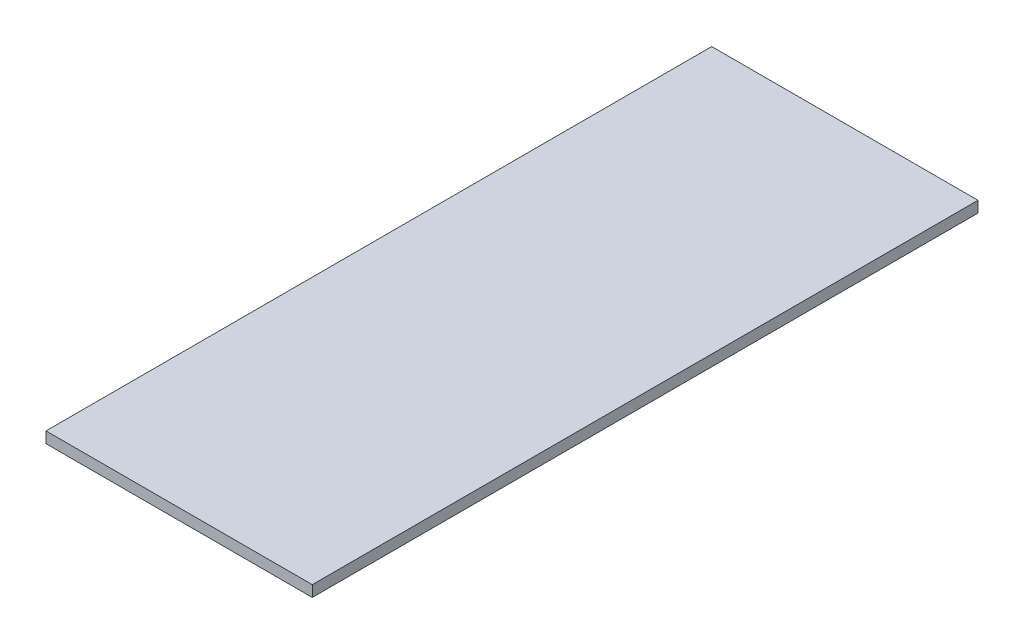
ISO-10303-21;
HEADER;
FILE_DESCRIPTION(('STEP AP214'),'2;1');
FILE_NAME('part.step','',(''),(''),'','','');
FILE_SCHEMA(('AUTOMOTIVE_DESIGN { 1 0 10303 214 1 1 1 1 }'));
ENDSEC;
DATA;
#1=APPLICATION_CONTEXT('core data for automotive mechanical design processes');
#2=APPLICATION_PROTOCOL_DEFINITION('international standard','automotive_design',2000,#1);
#3=PRODUCT_CONTEXT('',#1,'mechanical');
#4=PRODUCT('Part','Part','',(#3));
#5=PRODUCT_RELATED_PRODUCT_CATEGORY('part','',(#4));
#6=PRODUCT_DEFINITION_FORMATION('','',#4);
#7=PRODUCT_DEFINITION_CONTEXT('part definition',#1,'design');
#8=PRODUCT_DEFINITION('design','',#6,#7);
#9=PRODUCT_DEFINITION_SHAPE('','',#8);
#10=(LENGTH_UNIT() NAMED_UNIT(*) SI_UNIT(.MILLI.,.METRE.));
#11=(NAMED_UNIT(*) PLANE_ANGLE_UNIT() SI_UNIT($,.RADIAN.));
#12=(NAMED_UNIT(*) SI_UNIT($,.STERADIAN.) SOLID_ANGLE_UNIT());
#13=UNCERTAINTY_MEASURE_WITH_UNIT(LENGTH_MEASURE(1.E-05),#10,'distance_accuracy_value','');
#14=(GEOMETRIC_REPRESENTATION_CONTEXT(3) GLOBAL_UNCERTAINTY_ASSIGNED_CONTEXT((#13)) GLOBAL_UNIT_ASSIGNED_CONTEXT((#10,
#11,#12)) REPRESENTATION_CONTEXT('',''));
#15=CARTESIAN_POINT('',(0.,0.,0.));
#16=DIRECTION('',(0.,0.,1.));
#17=DIRECTION('',(1.,0.,0.));
#18=AXIS2_PLACEMENT_3D('',#15,#16,#17);
#19=CARTESIAN_POINT('',(0.,6.35,0.));
#20=DIRECTION('',(1.,0.,0.));
#21=DIRECTION('',(0.,0.,-1.));
#22=AXIS2_PLACEMENT_3D('',#19,#20,#21);
#23=PLANE('',#22);
#24=DIRECTION('',(0.,0.,1.));
#25=VECTOR('',#24,1.);
#26=CARTESIAN_POINT('',(0.,0.,0.));
#27=LINE('',#26,#25);
#28=CARTESIAN_POINT('',(0.,0.,-381.));
#29=VERTEX_POINT('',#28);
#30=CARTESIAN_POINT('',(0.,0.,0.));
#31=VERTEX_POINT('',#30);
#32=EDGE_CURVE('E80',#29,#31,#27,.T.);
#33=ORIENTED_EDGE('',*,*,#32,.T.);
#34=DIRECTION('',(0.,-1.,0.));
#35=VECTOR('',#34,1.);
#36=CARTESIAN_POINT('',(0.,6.35,0.));
#37=LINE('',#36,#35);
#38=CARTESIAN_POINT('',(0.,6.35,0.));
#39=VERTEX_POINT('',#38);
#40=EDGE_CURVE('E11',#39,#31,#37,.T.);
#41=ORIENTED_EDGE('',*,*,#40,.F.);
#42=DIRECTION('',(0.,0.,1.));
#43=VECTOR('',#42,1.);
#44=CARTESIAN_POINT('',(0.,6.35,0.));
#45=LINE('',#44,#43);
#46=CARTESIAN_POINT('',(0.,6.35,-381.));
#47=VERTEX_POINT('',#46);
#48=EDGE_CURVE('E68',#47,#39,#45,.T.);
#49=ORIENTED_EDGE('',*,*,#48,.F.);
#50=DIRECTION('',(0.,-1.,0.));
#51=VECTOR('',#50,1.);
#52=CARTESIAN_POINT('',(0.,6.35,-381.));
#53=LINE('',#52,#51);
#54=EDGE_CURVE('E76',#47,#29,#53,.T.);
#55=ORIENTED_EDGE('',*,*,#54,.T.);
#56=EDGE_LOOP('',(#33,#41,#49,#55));
#57=FACE_BOUND('',#56,.T.);
#58=ADVANCED_FACE('F17',(#57),#23,.F.);
#59=CARTESIAN_POINT('',(0.,6.35,0.));
#60=DIRECTION('',(0.,0.,-1.));
#61=DIRECTION('',(-1.,0.,0.));
#62=AXIS2_PLACEMENT_3D('',#59,#60,#61);
#63=PLANE('',#62);
#64=DIRECTION('',(1.,0.,0.));
#65=VECTOR('',#64,1.);
#66=CARTESIAN_POINT('',(0.,0.,0.));
#67=LINE('',#66,#65);
#68=CARTESIAN_POINT('',(152.4,0.,0.));
#69=VERTEX_POINT('',#68);
#70=EDGE_CURVE('E72',#31,#69,#67,.T.);
#71=ORIENTED_EDGE('',*,*,#70,.T.);
#72=DIRECTION('',(0.,-1.,0.));
#73=VECTOR('',#72,1.);
#74=CARTESIAN_POINT('',(152.4,6.35,0.));
#75=LINE('',#74,#73);
#76=CARTESIAN_POINT('',(152.4,6.35,0.));
#77=VERTEX_POINT('',#76);
#78=EDGE_CURVE('E25',#77,#69,#75,.T.);
#79=ORIENTED_EDGE('',*,*,#78,.F.);
#80=DIRECTION('',(1.,0.,0.));
#81=VECTOR('',#80,1.);
#82=CARTESIAN_POINT('',(0.,6.35,0.));
#83=LINE('',#82,#81);
#84=EDGE_CURVE('E63',#39,#77,#83,.T.);
#85=ORIENTED_EDGE('',*,*,#84,.F.);
#86=ORIENTED_EDGE('',*,*,#40,.T.);
#87=EDGE_LOOP('',(#71,#79,#85,#86));
#88=FACE_BOUND('',#87,.T.);
#89=ADVANCED_FACE('F71',(#88),#63,.F.);
#90=CARTESIAN_POINT('',(152.4,6.35,0.));
#91=DIRECTION('',(-1.,0.,0.));
#92=DIRECTION('',(0.,0.,1.));
#93=AXIS2_PLACEMENT_3D('',#90,#91,#92);
#94=PLANE('',#93);
#95=DIRECTION('',(0.,0.,-1.));
#96=VECTOR('',#95,1.);
#97=CARTESIAN_POINT('',(152.4,0.,0.));
#98=LINE('',#97,#96);
#99=CARTESIAN_POINT('',(152.4,0.,-381.));
#100=VERTEX_POINT('',#99);
#101=EDGE_CURVE('E50',#69,#100,#98,.T.);
#102=ORIENTED_EDGE('',*,*,#101,.T.);
#103=DIRECTION('',(0.,-1.,0.));
#104=VECTOR('',#103,1.);
#105=CARTESIAN_POINT('',(152.4,6.35,-381.));
#106=LINE('',#105,#104);
#107=CARTESIAN_POINT('',(152.4,6.35,-381.));
#108=VERTEX_POINT('',#107);
#109=EDGE_CURVE('E73',#108,#100,#106,.T.);
#110=ORIENTED_EDGE('',*,*,#109,.F.);
#111=DIRECTION('',(0.,0.,-1.));
#112=VECTOR('',#111,1.);
#113=CARTESIAN_POINT('',(152.4,6.35,0.));
#114=LINE('',#113,#112);
#115=EDGE_CURVE('E66',#77,#108,#114,.T.);
#116=ORIENTED_EDGE('',*,*,#115,.F.);
#117=ORIENTED_EDGE('',*,*,#78,.T.);
#118=EDGE_LOOP('',(#102,#110,#116,#117));
#119=FACE_BOUND('',#118,.T.);
#120=ADVANCED_FACE('F74',(#119),#94,.F.);
#121=CARTESIAN_POINT('',(0.,6.35,-381.));
#122=DIRECTION('',(0.,0.,1.));
#123=DIRECTION('',(1.,0.,0.));
#124=AXIS2_PLACEMENT_3D('',#121,#122,#123);
#125=PLANE('',#124);
#126=DIRECTION('',(-1.,0.,0.));
#127=VECTOR('',#126,1.);
#128=CARTESIAN_POINT('',(0.,0.,-381.));
#129=LINE('',#128,#127);
#130=EDGE_CURVE('E56',#100,#29,#129,.T.);
#131=ORIENTED_EDGE('',*,*,#130,.T.);
#132=ORIENTED_EDGE('',*,*,#54,.F.);
#133=DIRECTION('',(-1.,0.,0.));
#134=VECTOR('',#133,1.);
#135=CARTESIAN_POINT('',(0.,6.35,-381.));
#136=LINE('',#135,#134);
#137=EDGE_CURVE('E33',#108,#47,#136,.T.);
#138=ORIENTED_EDGE('',*,*,#137,.F.);
#139=ORIENTED_EDGE('',*,*,#109,.T.);
#140=EDGE_LOOP('',(#131,#132,#138,#139));
#141=FACE_BOUND('',#140,.T.);
#142=ADVANCED_FACE('F87',(#141),#125,.F.);
#143=CARTESIAN_POINT('',(0.,6.35,-381.));
#144=DIRECTION('',(0.,-1.,0.));
#145=DIRECTION('',(0.,0.,-1.));
#146=AXIS2_PLACEMENT_3D('',#143,#144,#145);
#147=PLANE('',#146);
#148=ORIENTED_EDGE('',*,*,#48,.T.);
#149=ORIENTED_EDGE('',*,*,#84,.T.);
#150=ORIENTED_EDGE('',*,*,#115,.T.);
#151=ORIENTED_EDGE('',*,*,#137,.T.);
#152=EDGE_LOOP('',(#148,#149,#150,#151));
#153=FACE_BOUND('',#152,.T.);
#154=ADVANCED_FACE('F64',(#153),#147,.F.);
#155=CARTESIAN_POINT('',(0.,0.,-381.));
#156=DIRECTION('',(0.,-1.,0.));
#157=DIRECTION('',(0.,0.,-1.));
#158=AXIS2_PLACEMENT_3D('',#155,#156,#157);
#159=PLANE('',#158);
#160=ORIENTED_EDGE('',*,*,#32,.F.);
#161=ORIENTED_EDGE('',*,*,#130,.F.);
#162=ORIENTED_EDGE('',*,*,#101,.F.);
#163=ORIENTED_EDGE('',*,*,#70,.F.);
#164=EDGE_LOOP('',(#160,#161,#162,#163));
#165=FACE_BOUND('',#164,.T.);
#166=ADVANCED_FACE('F90',(#165),#159,.T.);
#167=CLOSED_SHELL('',(#58,#89,#120,#142,#154,#166));
#168=MANIFOLD_SOLID_BREP('B1',#167);
#169=ADVANCED_BREP_SHAPE_REPRESENTATION('',(#18,#168),#14);
#170=SHAPE_DEFINITION_REPRESENTATION(#9,#169);
ENDSEC;
END-ISO-10303-21;
